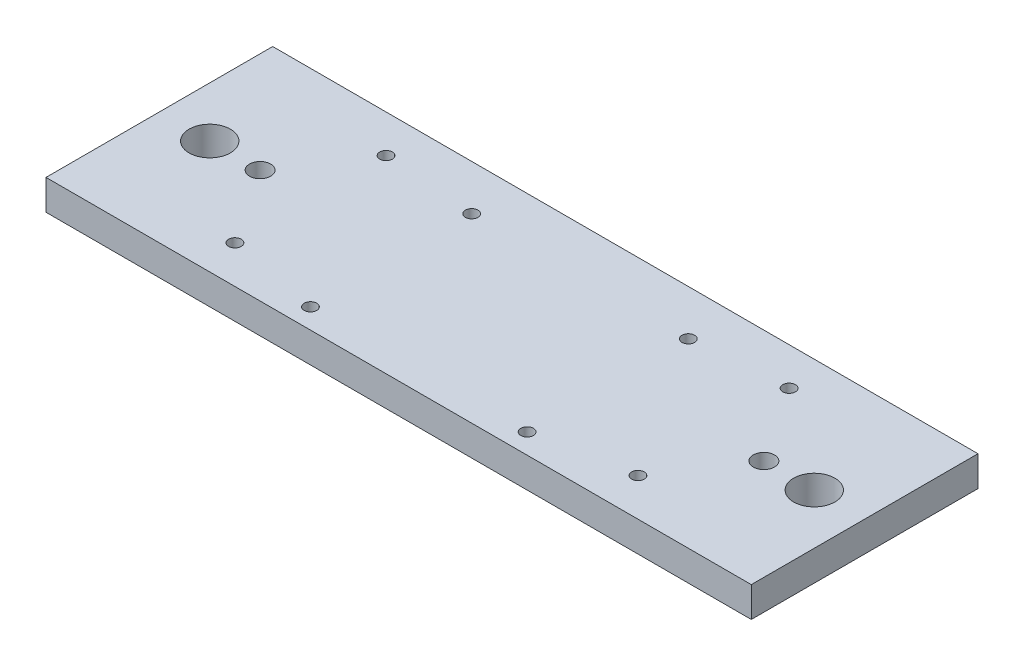
ISO-10303-21;
HEADER;
FILE_DESCRIPTION(('STEP AP214'),'2;1');
FILE_NAME('part.step','',(''),(''),'','','');
FILE_SCHEMA(('AUTOMOTIVE_DESIGN { 1 0 10303 214 1 1 1 1 }'));
ENDSEC;
DATA;
#1=APPLICATION_CONTEXT('core data for automotive mechanical design processes');
#2=APPLICATION_PROTOCOL_DEFINITION('international standard','automotive_design',2000,#1);
#3=PRODUCT_CONTEXT('',#1,'mechanical');
#4=PRODUCT('Part','Part','',(#3));
#5=PRODUCT_RELATED_PRODUCT_CATEGORY('part','',(#4));
#6=PRODUCT_DEFINITION_FORMATION('','',#4);
#7=PRODUCT_DEFINITION_CONTEXT('part definition',#1,'design');
#8=PRODUCT_DEFINITION('design','',#6,#7);
#9=PRODUCT_DEFINITION_SHAPE('','',#8);
#10=(LENGTH_UNIT() NAMED_UNIT(*) SI_UNIT(.MILLI.,.METRE.));
#11=(NAMED_UNIT(*) PLANE_ANGLE_UNIT() SI_UNIT($,.RADIAN.));
#12=(NAMED_UNIT(*) SI_UNIT($,.STERADIAN.) SOLID_ANGLE_UNIT());
#13=UNCERTAINTY_MEASURE_WITH_UNIT(LENGTH_MEASURE(1.E-05),#10,'distance_accuracy_value','');
#14=(GEOMETRIC_REPRESENTATION_CONTEXT(3) GLOBAL_UNCERTAINTY_ASSIGNED_CONTEXT((#13)) GLOBAL_UNIT_ASSIGNED_CONTEXT((#10,
#11,#12)) REPRESENTATION_CONTEXT('',''));
#15=CARTESIAN_POINT('',(0.,0.,0.));
#16=DIRECTION('',(0.,0.,1.));
#17=DIRECTION('',(1.,0.,0.));
#18=AXIS2_PLACEMENT_3D('',#15,#16,#17);
#19=CARTESIAN_POINT('',(0.,6.,0.));
#20=DIRECTION('',(0.,1.,0.));
#21=DIRECTION('',(0.,0.,1.));
#22=AXIS2_PLACEMENT_3D('',#19,#20,#21);
#23=PLANE('',#22);
#24=CARTESIAN_POINT('',(50.,6.,0.));
#25=DIRECTION('',(0.,1.,0.));
#26=DIRECTION('',(0.,0.,1.));
#27=AXIS2_PLACEMENT_3D('',#24,#25,#26);
#28=CIRCLE('',#27,2.09999999999997);
#29=CARTESIAN_POINT('',(50.,6.,2.09999999999997));
#30=VERTEX_POINT('',#29);
#31=EDGE_CURVE('E184',#30,#30,#28,.T.);
#32=ORIENTED_EDGE('',*,*,#31,.F.);
#33=EDGE_LOOP('',(#32));
#34=FACE_BOUND('',#33,.T.);
#35=CARTESIAN_POINT('',(-50.,6.,0.));
#36=DIRECTION('',(0.,1.,0.));
#37=DIRECTION('',(0.,0.,1.));
#38=AXIS2_PLACEMENT_3D('',#35,#36,#37);
#39=CIRCLE('',#38,2.09999999999997);
#40=CARTESIAN_POINT('',(-50.,6.,2.09999999999997));
#41=VERTEX_POINT('',#40);
#42=EDGE_CURVE('E178',#41,#41,#39,.T.);
#43=ORIENTED_EDGE('',*,*,#42,.F.);
#44=EDGE_LOOP('',(#43));
#45=FACE_BOUND('',#44,.T.);
#46=CARTESIAN_POINT('',(-21.5,6.,-13.5));
#47=DIRECTION('',(0.,1.,0.));
#48=DIRECTION('',(0.,0.,1.));
#49=AXIS2_PLACEMENT_3D('',#46,#47,#48);
#50=CIRCLE('',#49,1.24999999999999);
#51=CARTESIAN_POINT('',(-21.5,6.,-12.25));
#52=VERTEX_POINT('',#51);
#53=EDGE_CURVE('E172',#52,#52,#50,.T.);
#54=ORIENTED_EDGE('',*,*,#53,.F.);
#55=EDGE_LOOP('',(#54));
#56=FACE_BOUND('',#55,.T.);
#57=CARTESIAN_POINT('',(21.5,6.,-13.5));
#58=DIRECTION('',(0.,1.,0.));
#59=DIRECTION('',(0.,0.,1.));
#60=AXIS2_PLACEMENT_3D('',#57,#58,#59);
#61=CIRCLE('',#60,1.24999999999999);
#62=CARTESIAN_POINT('',(21.5,6.,-12.25));
#63=VERTEX_POINT('',#62);
#64=EDGE_CURVE('E166',#63,#63,#61,.T.);
#65=ORIENTED_EDGE('',*,*,#64,.F.);
#66=EDGE_LOOP('',(#65));
#67=FACE_BOUND('',#66,.T.);
#68=CARTESIAN_POINT('',(21.5,6.,18.5));
#69=DIRECTION('',(0.,1.,0.));
#70=DIRECTION('',(0.,0.,1.));
#71=AXIS2_PLACEMENT_3D('',#68,#69,#70);
#72=CIRCLE('',#71,1.24999999999999);
#73=CARTESIAN_POINT('',(21.5,6.,19.75));
#74=VERTEX_POINT('',#73);
#75=EDGE_CURVE('E160',#74,#74,#72,.T.);
#76=ORIENTED_EDGE('',*,*,#75,.F.);
#77=EDGE_LOOP('',(#76));
#78=FACE_BOUND('',#77,.T.);
#79=CARTESIAN_POINT('',(-21.5,6.,18.5));
#80=DIRECTION('',(0.,1.,0.));
#81=DIRECTION('',(0.,0.,1.));
#82=AXIS2_PLACEMENT_3D('',#79,#80,#81);
#83=CIRCLE('',#82,1.24999999999999);
#84=CARTESIAN_POINT('',(-21.5,6.,19.75));
#85=VERTEX_POINT('',#84);
#86=EDGE_CURVE('E154',#85,#85,#83,.T.);
#87=ORIENTED_EDGE('',*,*,#86,.F.);
#88=EDGE_LOOP('',(#87));
#89=FACE_BOUND('',#88,.T.);
#90=CARTESIAN_POINT('',(-40.,6.,-15.));
#91=DIRECTION('',(0.,1.,0.));
#92=DIRECTION('',(0.,0.,1.));
#93=AXIS2_PLACEMENT_3D('',#90,#91,#92);
#94=CIRCLE('',#93,1.24999999999999);
#95=CARTESIAN_POINT('',(-40.,6.,-13.75));
#96=VERTEX_POINT('',#95);
#97=EDGE_CURVE('E148',#96,#96,#94,.T.);
#98=ORIENTED_EDGE('',*,*,#97,.F.);
#99=EDGE_LOOP('',(#98));
#100=FACE_BOUND('',#99,.T.);
#101=CARTESIAN_POINT('',(-40.,6.,15.));
#102=DIRECTION('',(0.,1.,0.));
#103=DIRECTION('',(0.,0.,1.));
#104=AXIS2_PLACEMENT_3D('',#101,#102,#103);
#105=CIRCLE('',#104,1.24999999999999);
#106=CARTESIAN_POINT('',(-40.,6.,16.25));
#107=VERTEX_POINT('',#106);
#108=EDGE_CURVE('E142',#107,#107,#105,.T.);
#109=ORIENTED_EDGE('',*,*,#108,.F.);
#110=EDGE_LOOP('',(#109));
#111=FACE_BOUND('',#110,.T.);
#112=CARTESIAN_POINT('',(40.,6.,15.));
#113=DIRECTION('',(0.,1.,0.));
#114=DIRECTION('',(0.,0.,1.));
#115=AXIS2_PLACEMENT_3D('',#112,#113,#114);
#116=CIRCLE('',#115,1.24999999999999);
#117=CARTESIAN_POINT('',(40.,6.,16.25));
#118=VERTEX_POINT('',#117);
#119=EDGE_CURVE('E136',#118,#118,#116,.T.);
#120=ORIENTED_EDGE('',*,*,#119,.F.);
#121=EDGE_LOOP('',(#120));
#122=FACE_BOUND('',#121,.T.);
#123=CARTESIAN_POINT('',(40.,6.,-15.));
#124=DIRECTION('',(0.,1.,0.));
#125=DIRECTION('',(0.,0.,1.));
#126=AXIS2_PLACEMENT_3D('',#123,#124,#125);
#127=CIRCLE('',#126,1.24999999999999);
#128=CARTESIAN_POINT('',(40.,6.,-13.75));
#129=VERTEX_POINT('',#128);
#130=EDGE_CURVE('E130',#129,#129,#127,.T.);
#131=ORIENTED_EDGE('',*,*,#130,.F.);
#132=EDGE_LOOP('',(#131));
#133=FACE_BOUND('',#132,.T.);
#134=CARTESIAN_POINT('',(60.,6.,0.));
#135=DIRECTION('',(0.,1.,0.));
#136=DIRECTION('',(0.,0.,1.));
#137=AXIS2_PLACEMENT_3D('',#134,#135,#136);
#138=CIRCLE('',#137,4.1);
#139=CARTESIAN_POINT('',(60.,6.,4.1));
#140=VERTEX_POINT('',#139);
#141=EDGE_CURVE('E104',#140,#140,#138,.T.);
#142=ORIENTED_EDGE('',*,*,#141,.F.);
#143=EDGE_LOOP('',(#142));
#144=FACE_BOUND('',#143,.T.);
#145=DIRECTION('',(0.,0.,1.));
#146=VECTOR('',#145,1.);
#147=CARTESIAN_POINT('',(-70.,6.,-22.5));
#148=LINE('',#147,#146);
#149=CARTESIAN_POINT('',(-70.,6.,-22.5));
#150=VERTEX_POINT('',#149);
#151=CARTESIAN_POINT('',(-70.,6.,22.5));
#152=VERTEX_POINT('',#151);
#153=EDGE_CURVE('E89',#150,#152,#148,.T.);
#154=ORIENTED_EDGE('',*,*,#153,.T.);
#155=DIRECTION('',(1.,0.,0.));
#156=VECTOR('',#155,1.);
#157=CARTESIAN_POINT('',(-70.,6.,22.5));
#158=LINE('',#157,#156);
#159=CARTESIAN_POINT('',(70.,6.,22.5));
#160=VERTEX_POINT('',#159);
#161=EDGE_CURVE('E84',#152,#160,#158,.T.);
#162=ORIENTED_EDGE('',*,*,#161,.T.);
#163=DIRECTION('',(0.,0.,-1.));
#164=VECTOR('',#163,1.);
#165=CARTESIAN_POINT('',(70.,6.,-22.5));
#166=LINE('',#165,#164);
#167=CARTESIAN_POINT('',(70.,6.,-22.5));
#168=VERTEX_POINT('',#167);
#169=EDGE_CURVE('E87',#160,#168,#166,.T.);
#170=ORIENTED_EDGE('',*,*,#169,.T.);
#171=DIRECTION('',(-1.,0.,0.));
#172=VECTOR('',#171,1.);
#173=CARTESIAN_POINT('',(-70.,6.,-22.5));
#174=LINE('',#173,#172);
#175=EDGE_CURVE('E54',#168,#150,#174,.T.);
#176=ORIENTED_EDGE('',*,*,#175,.T.);
#177=EDGE_LOOP('',(#154,#162,#170,#176));
#178=FACE_BOUND('',#177,.T.);
#179=CARTESIAN_POINT('',(-60.,6.,0.));
#180=DIRECTION('',(0.,1.,0.));
#181=DIRECTION('',(0.,0.,1.));
#182=AXIS2_PLACEMENT_3D('',#179,#180,#181);
#183=CIRCLE('',#182,4.1);
#184=CARTESIAN_POINT('',(-60.,6.,4.1));
#185=VERTEX_POINT('',#184);
#186=EDGE_CURVE('E119',#185,#185,#183,.T.);
#187=ORIENTED_EDGE('',*,*,#186,.F.);
#188=EDGE_LOOP('',(#187));
#189=FACE_BOUND('',#188,.T.);
#190=ADVANCED_FACE('F37',(#34,#45,#56,#67,#78,#89,#100,#111,#122,#133,#144,#178,#189),#23,.T.);
#191=CARTESIAN_POINT('',(0.,0.,0.));
#192=DIRECTION('',(0.,1.,0.));
#193=DIRECTION('',(0.,0.,1.));
#194=AXIS2_PLACEMENT_3D('',#191,#192,#193);
#195=PLANE('',#194);
#196=CARTESIAN_POINT('',(50.,0.,0.));
#197=DIRECTION('',(0.,1.,0.));
#198=DIRECTION('',(0.,0.,1.));
#199=AXIS2_PLACEMENT_3D('',#196,#197,#198);
#200=CIRCLE('',#199,2.09999999999997);
#201=CARTESIAN_POINT('',(50.,0.,2.09999999999997));
#202=VERTEX_POINT('',#201);
#203=EDGE_CURVE('E181',#202,#202,#200,.T.);
#204=ORIENTED_EDGE('',*,*,#203,.T.);
#205=EDGE_LOOP('',(#204));
#206=FACE_BOUND('',#205,.T.);
#207=CARTESIAN_POINT('',(-50.,0.,0.));
#208=DIRECTION('',(0.,1.,0.));
#209=DIRECTION('',(0.,0.,1.));
#210=AXIS2_PLACEMENT_3D('',#207,#208,#209);
#211=CIRCLE('',#210,2.09999999999997);
#212=CARTESIAN_POINT('',(-50.,0.,2.09999999999997));
#213=VERTEX_POINT('',#212);
#214=EDGE_CURVE('E175',#213,#213,#211,.T.);
#215=ORIENTED_EDGE('',*,*,#214,.T.);
#216=EDGE_LOOP('',(#215));
#217=FACE_BOUND('',#216,.T.);
#218=CARTESIAN_POINT('',(-21.5,0.,-13.5));
#219=DIRECTION('',(0.,1.,0.));
#220=DIRECTION('',(0.,0.,1.));
#221=AXIS2_PLACEMENT_3D('',#218,#219,#220);
#222=CIRCLE('',#221,1.25);
#223=CARTESIAN_POINT('',(-21.5,0.,-12.25));
#224=VERTEX_POINT('',#223);
#225=EDGE_CURVE('E169',#224,#224,#222,.T.);
#226=ORIENTED_EDGE('',*,*,#225,.T.);
#227=EDGE_LOOP('',(#226));
#228=FACE_BOUND('',#227,.T.);
#229=CARTESIAN_POINT('',(21.5,0.,-13.5));
#230=DIRECTION('',(0.,1.,0.));
#231=DIRECTION('',(0.,0.,1.));
#232=AXIS2_PLACEMENT_3D('',#229,#230,#231);
#233=CIRCLE('',#232,1.25);
#234=CARTESIAN_POINT('',(21.5,0.,-12.25));
#235=VERTEX_POINT('',#234);
#236=EDGE_CURVE('E163',#235,#235,#233,.T.);
#237=ORIENTED_EDGE('',*,*,#236,.T.);
#238=EDGE_LOOP('',(#237));
#239=FACE_BOUND('',#238,.T.);
#240=CARTESIAN_POINT('',(21.5,0.,18.5));
#241=DIRECTION('',(0.,1.,0.));
#242=DIRECTION('',(0.,0.,1.));
#243=AXIS2_PLACEMENT_3D('',#240,#241,#242);
#244=CIRCLE('',#243,1.25);
#245=CARTESIAN_POINT('',(21.5,0.,19.75));
#246=VERTEX_POINT('',#245);
#247=EDGE_CURVE('E157',#246,#246,#244,.T.);
#248=ORIENTED_EDGE('',*,*,#247,.T.);
#249=EDGE_LOOP('',(#248));
#250=FACE_BOUND('',#249,.T.);
#251=CARTESIAN_POINT('',(-21.5,0.,18.5));
#252=DIRECTION('',(0.,1.,0.));
#253=DIRECTION('',(0.,0.,1.));
#254=AXIS2_PLACEMENT_3D('',#251,#252,#253);
#255=CIRCLE('',#254,1.25);
#256=CARTESIAN_POINT('',(-21.5,0.,19.75));
#257=VERTEX_POINT('',#256);
#258=EDGE_CURVE('E151',#257,#257,#255,.T.);
#259=ORIENTED_EDGE('',*,*,#258,.T.);
#260=EDGE_LOOP('',(#259));
#261=FACE_BOUND('',#260,.T.);
#262=CARTESIAN_POINT('',(-40.,0.,-15.));
#263=DIRECTION('',(0.,1.,0.));
#264=DIRECTION('',(0.,0.,1.));
#265=AXIS2_PLACEMENT_3D('',#262,#263,#264);
#266=CIRCLE('',#265,1.25);
#267=CARTESIAN_POINT('',(-40.,0.,-13.75));
#268=VERTEX_POINT('',#267);
#269=EDGE_CURVE('E145',#268,#268,#266,.T.);
#270=ORIENTED_EDGE('',*,*,#269,.T.);
#271=EDGE_LOOP('',(#270));
#272=FACE_BOUND('',#271,.T.);
#273=CARTESIAN_POINT('',(-40.,0.,15.));
#274=DIRECTION('',(0.,1.,0.));
#275=DIRECTION('',(0.,0.,1.));
#276=AXIS2_PLACEMENT_3D('',#273,#274,#275);
#277=CIRCLE('',#276,1.25);
#278=CARTESIAN_POINT('',(-40.,0.,16.25));
#279=VERTEX_POINT('',#278);
#280=EDGE_CURVE('E139',#279,#279,#277,.T.);
#281=ORIENTED_EDGE('',*,*,#280,.T.);
#282=EDGE_LOOP('',(#281));
#283=FACE_BOUND('',#282,.T.);
#284=CARTESIAN_POINT('',(40.,0.,15.));
#285=DIRECTION('',(0.,1.,0.));
#286=DIRECTION('',(0.,0.,1.));
#287=AXIS2_PLACEMENT_3D('',#284,#285,#286);
#288=CIRCLE('',#287,1.25);
#289=CARTESIAN_POINT('',(40.,0.,16.25));
#290=VERTEX_POINT('',#289);
#291=EDGE_CURVE('E133',#290,#290,#288,.T.);
#292=ORIENTED_EDGE('',*,*,#291,.T.);
#293=EDGE_LOOP('',(#292));
#294=FACE_BOUND('',#293,.T.);
#295=CARTESIAN_POINT('',(40.,0.,-15.));
#296=DIRECTION('',(0.,1.,0.));
#297=DIRECTION('',(0.,0.,1.));
#298=AXIS2_PLACEMENT_3D('',#295,#296,#297);
#299=CIRCLE('',#298,1.25);
#300=CARTESIAN_POINT('',(40.,0.,-13.75));
#301=VERTEX_POINT('',#300);
#302=EDGE_CURVE('E125',#301,#301,#299,.T.);
#303=ORIENTED_EDGE('',*,*,#302,.T.);
#304=EDGE_LOOP('',(#303));
#305=FACE_BOUND('',#304,.T.);
#306=DIRECTION('',(0.,0.,1.));
#307=VECTOR('',#306,1.);
#308=CARTESIAN_POINT('',(-70.,0.,-22.5));
#309=LINE('',#308,#307);
#310=CARTESIAN_POINT('',(-70.,0.,-22.5));
#311=VERTEX_POINT('',#310);
#312=CARTESIAN_POINT('',(-70.,0.,22.5));
#313=VERTEX_POINT('',#312);
#314=EDGE_CURVE('E101',#311,#313,#309,.T.);
#315=ORIENTED_EDGE('',*,*,#314,.F.);
#316=DIRECTION('',(-1.,0.,0.));
#317=VECTOR('',#316,1.);
#318=CARTESIAN_POINT('',(-70.,0.,-22.5));
#319=LINE('',#318,#317);
#320=CARTESIAN_POINT('',(70.,0.,-22.5));
#321=VERTEX_POINT('',#320);
#322=EDGE_CURVE('E77',#321,#311,#319,.T.);
#323=ORIENTED_EDGE('',*,*,#322,.F.);
#324=DIRECTION('',(0.,0.,-1.));
#325=VECTOR('',#324,1.);
#326=CARTESIAN_POINT('',(70.,0.,-22.5));
#327=LINE('',#326,#325);
#328=CARTESIAN_POINT('',(70.,0.,22.5));
#329=VERTEX_POINT('',#328);
#330=EDGE_CURVE('E71',#329,#321,#327,.T.);
#331=ORIENTED_EDGE('',*,*,#330,.F.);
#332=DIRECTION('',(1.,0.,0.));
#333=VECTOR('',#332,1.);
#334=CARTESIAN_POINT('',(-70.,0.,22.5));
#335=LINE('',#334,#333);
#336=EDGE_CURVE('E93',#313,#329,#335,.T.);
#337=ORIENTED_EDGE('',*,*,#336,.F.);
#338=EDGE_LOOP('',(#315,#323,#331,#337));
#339=FACE_BOUND('',#338,.T.);
#340=CARTESIAN_POINT('',(60.,0.,0.));
#341=DIRECTION('',(0.,1.,0.));
#342=DIRECTION('',(0.,0.,1.));
#343=AXIS2_PLACEMENT_3D('',#340,#341,#342);
#344=CIRCLE('',#343,4.1);
#345=CARTESIAN_POINT('',(60.,0.,4.1));
#346=VERTEX_POINT('',#345);
#347=EDGE_CURVE('E116',#346,#346,#344,.T.);
#348=ORIENTED_EDGE('',*,*,#347,.T.);
#349=EDGE_LOOP('',(#348));
#350=FACE_BOUND('',#349,.T.);
#351=CARTESIAN_POINT('',(-60.,0.,0.));
#352=DIRECTION('',(0.,1.,0.));
#353=DIRECTION('',(0.,0.,1.));
#354=AXIS2_PLACEMENT_3D('',#351,#352,#353);
#355=CIRCLE('',#354,4.1);
#356=CARTESIAN_POINT('',(-60.,0.,4.1));
#357=VERTEX_POINT('',#356);
#358=EDGE_CURVE('E122',#357,#357,#355,.T.);
#359=ORIENTED_EDGE('',*,*,#358,.T.);
#360=EDGE_LOOP('',(#359));
#361=FACE_BOUND('',#360,.T.);
#362=ADVANCED_FACE('F112',(#206,#217,#228,#239,#250,#261,#272,#283,#294,#305,#339,#350,#361),
#195,.F.);
#363=CARTESIAN_POINT('',(-70.,6.,-22.5));
#364=DIRECTION('',(1.,0.,0.));
#365=DIRECTION('',(0.,0.,-1.));
#366=AXIS2_PLACEMENT_3D('',#363,#364,#365);
#367=PLANE('',#366);
#368=ORIENTED_EDGE('',*,*,#314,.T.);
#369=DIRECTION('',(0.,-1.,0.));
#370=VECTOR('',#369,1.);
#371=CARTESIAN_POINT('',(-70.,6.,22.5));
#372=LINE('',#371,#370);
#373=EDGE_CURVE('E11',#152,#313,#372,.T.);
#374=ORIENTED_EDGE('',*,*,#373,.F.);
#375=ORIENTED_EDGE('',*,*,#153,.F.);
#376=DIRECTION('',(0.,-1.,0.));
#377=VECTOR('',#376,1.);
#378=CARTESIAN_POINT('',(-70.,6.,-22.5));
#379=LINE('',#378,#377);
#380=EDGE_CURVE('E97',#150,#311,#379,.T.);
#381=ORIENTED_EDGE('',*,*,#380,.T.);
#382=EDGE_LOOP('',(#368,#374,#375,#381));
#383=FACE_BOUND('',#382,.T.);
#384=ADVANCED_FACE('F39',(#383),#367,.F.);
#385=CARTESIAN_POINT('',(-70.,6.,22.5));
#386=DIRECTION('',(0.,0.,-1.));
#387=DIRECTION('',(-1.,0.,0.));
#388=AXIS2_PLACEMENT_3D('',#385,#386,#387);
#389=PLANE('',#388);
#390=ORIENTED_EDGE('',*,*,#336,.T.);
#391=DIRECTION('',(0.,-1.,0.));
#392=VECTOR('',#391,1.);
#393=CARTESIAN_POINT('',(70.,6.,22.5));
#394=LINE('',#393,#392);
#395=EDGE_CURVE('E46',#160,#329,#394,.T.);
#396=ORIENTED_EDGE('',*,*,#395,.F.);
#397=ORIENTED_EDGE('',*,*,#161,.F.);
#398=ORIENTED_EDGE('',*,*,#373,.T.);
#399=EDGE_LOOP('',(#390,#396,#397,#398));
#400=FACE_BOUND('',#399,.T.);
#401=ADVANCED_FACE('F92',(#400),#389,.F.);
#402=CARTESIAN_POINT('',(70.,6.,-22.5));
#403=DIRECTION('',(-1.,0.,0.));
#404=DIRECTION('',(0.,0.,1.));
#405=AXIS2_PLACEMENT_3D('',#402,#403,#404);
#406=PLANE('',#405);
#407=ORIENTED_EDGE('',*,*,#330,.T.);
#408=DIRECTION('',(0.,-1.,0.));
#409=VECTOR('',#408,1.);
#410=CARTESIAN_POINT('',(70.,6.,-22.5));
#411=LINE('',#410,#409);
#412=EDGE_CURVE('E94',#168,#321,#411,.T.);
#413=ORIENTED_EDGE('',*,*,#412,.F.);
#414=ORIENTED_EDGE('',*,*,#169,.F.);
#415=ORIENTED_EDGE('',*,*,#395,.T.);
#416=EDGE_LOOP('',(#407,#413,#414,#415));
#417=FACE_BOUND('',#416,.T.);
#418=ADVANCED_FACE('F95',(#417),#406,.F.);
#419=CARTESIAN_POINT('',(-70.,6.,-22.5));
#420=DIRECTION('',(0.,0.,1.));
#421=DIRECTION('',(1.,0.,0.));
#422=AXIS2_PLACEMENT_3D('',#419,#420,#421);
#423=PLANE('',#422);
#424=ORIENTED_EDGE('',*,*,#322,.T.);
#425=ORIENTED_EDGE('',*,*,#380,.F.);
#426=ORIENTED_EDGE('',*,*,#175,.F.);
#427=ORIENTED_EDGE('',*,*,#412,.T.);
#428=EDGE_LOOP('',(#424,#425,#426,#427));
#429=FACE_BOUND('',#428,.T.);
#430=ADVANCED_FACE('F109',(#429),#423,.F.);
#431=CARTESIAN_POINT('',(60.,6.,0.));
#432=DIRECTION('',(0.,-1.,0.));
#433=DIRECTION('',(0.,0.,-1.));
#434=AXIS2_PLACEMENT_3D('',#431,#432,#433);
#435=CYLINDRICAL_SURFACE('',#434,4.1);
#436=ORIENTED_EDGE('',*,*,#141,.T.);
#437=EDGE_LOOP('',(#436));
#438=FACE_BOUND('',#437,.T.);
#439=ORIENTED_EDGE('',*,*,#347,.F.);
#440=EDGE_LOOP('',(#439));
#441=FACE_BOUND('',#440,.T.);
#442=ADVANCED_FACE('F213',(#438,#441),#435,.F.);
#443=CARTESIAN_POINT('',(-60.,6.,0.));
#444=DIRECTION('',(0.,-1.,0.));
#445=DIRECTION('',(0.,0.,-1.));
#446=AXIS2_PLACEMENT_3D('',#443,#444,#445);
#447=CYLINDRICAL_SURFACE('',#446,4.1);
#448=ORIENTED_EDGE('',*,*,#186,.T.);
#449=EDGE_LOOP('',(#448));
#450=FACE_BOUND('',#449,.T.);
#451=ORIENTED_EDGE('',*,*,#358,.F.);
#452=EDGE_LOOP('',(#451));
#453=FACE_BOUND('',#452,.T.);
#454=ADVANCED_FACE('F216',(#450,#453),#447,.F.);
#455=CARTESIAN_POINT('',(40.,6.,-15.));
#456=DIRECTION('',(0.,1.,0.));
#457=DIRECTION('',(0.,0.,1.));
#458=AXIS2_PLACEMENT_3D('',#455,#456,#457);
#459=CYLINDRICAL_SURFACE('',#458,1.24999999999999);
#460=ORIENTED_EDGE('',*,*,#302,.F.);
#461=EDGE_LOOP('',(#460));
#462=FACE_BOUND('',#461,.T.);
#463=ORIENTED_EDGE('',*,*,#130,.T.);
#464=EDGE_LOOP('',(#463));
#465=FACE_BOUND('',#464,.T.);
#466=ADVANCED_FACE('F226',(#462,#465),#459,.F.);
#467=CARTESIAN_POINT('',(40.,6.,15.));
#468=DIRECTION('',(0.,1.,0.));
#469=DIRECTION('',(0.,0.,1.));
#470=AXIS2_PLACEMENT_3D('',#467,#468,#469);
#471=CYLINDRICAL_SURFACE('',#470,1.24999999999999);
#472=ORIENTED_EDGE('',*,*,#291,.F.);
#473=EDGE_LOOP('',(#472));
#474=FACE_BOUND('',#473,.T.);
#475=ORIENTED_EDGE('',*,*,#119,.T.);
#476=EDGE_LOOP('',(#475));
#477=FACE_BOUND('',#476,.T.);
#478=ADVANCED_FACE('F232',(#474,#477),#471,.F.);
#479=CARTESIAN_POINT('',(-40.,6.,15.));
#480=DIRECTION('',(0.,1.,0.));
#481=DIRECTION('',(0.,0.,1.));
#482=AXIS2_PLACEMENT_3D('',#479,#480,#481);
#483=CYLINDRICAL_SURFACE('',#482,1.24999999999999);
#484=ORIENTED_EDGE('',*,*,#280,.F.);
#485=EDGE_LOOP('',(#484));
#486=FACE_BOUND('',#485,.T.);
#487=ORIENTED_EDGE('',*,*,#108,.T.);
#488=EDGE_LOOP('',(#487));
#489=FACE_BOUND('',#488,.T.);
#490=ADVANCED_FACE('F315',(#486,#489),#483,.F.);
#491=CARTESIAN_POINT('',(-40.,6.,-15.));
#492=DIRECTION('',(0.,1.,0.));
#493=DIRECTION('',(0.,0.,1.));
#494=AXIS2_PLACEMENT_3D('',#491,#492,#493);
#495=CYLINDRICAL_SURFACE('',#494,1.24999999999999);
#496=ORIENTED_EDGE('',*,*,#269,.F.);
#497=EDGE_LOOP('',(#496));
#498=FACE_BOUND('',#497,.T.);
#499=ORIENTED_EDGE('',*,*,#97,.T.);
#500=EDGE_LOOP('',(#499));
#501=FACE_BOUND('',#500,.T.);
#502=ADVANCED_FACE('F304',(#498,#501),#495,.F.);
#503=CARTESIAN_POINT('',(-21.5,6.,18.5));
#504=DIRECTION('',(0.,1.,0.));
#505=DIRECTION('',(0.,0.,1.));
#506=AXIS2_PLACEMENT_3D('',#503,#504,#505);
#507=CYLINDRICAL_SURFACE('',#506,1.24999999999999);
#508=ORIENTED_EDGE('',*,*,#258,.F.);
#509=EDGE_LOOP('',(#508));
#510=FACE_BOUND('',#509,.T.);
#511=ORIENTED_EDGE('',*,*,#86,.T.);
#512=EDGE_LOOP('',(#511));
#513=FACE_BOUND('',#512,.T.);
#514=ADVANCED_FACE('F293',(#510,#513),#507,.F.);
#515=CARTESIAN_POINT('',(21.5,6.,18.5));
#516=DIRECTION('',(0.,1.,0.));
#517=DIRECTION('',(0.,0.,1.));
#518=AXIS2_PLACEMENT_3D('',#515,#516,#517);
#519=CYLINDRICAL_SURFACE('',#518,1.24999999999999);
#520=ORIENTED_EDGE('',*,*,#247,.F.);
#521=EDGE_LOOP('',(#520));
#522=FACE_BOUND('',#521,.T.);
#523=ORIENTED_EDGE('',*,*,#75,.T.);
#524=EDGE_LOOP('',(#523));
#525=FACE_BOUND('',#524,.T.);
#526=ADVANCED_FACE('F282',(#522,#525),#519,.F.);
#527=CARTESIAN_POINT('',(21.5,6.,-13.5));
#528=DIRECTION('',(0.,1.,0.));
#529=DIRECTION('',(0.,0.,1.));
#530=AXIS2_PLACEMENT_3D('',#527,#528,#529);
#531=CYLINDRICAL_SURFACE('',#530,1.24999999999999);
#532=ORIENTED_EDGE('',*,*,#236,.F.);
#533=EDGE_LOOP('',(#532));
#534=FACE_BOUND('',#533,.T.);
#535=ORIENTED_EDGE('',*,*,#64,.T.);
#536=EDGE_LOOP('',(#535));
#537=FACE_BOUND('',#536,.T.);
#538=ADVANCED_FACE('F269',(#534,#537),#531,.F.);
#539=CARTESIAN_POINT('',(-21.5,6.,-13.5));
#540=DIRECTION('',(0.,1.,0.));
#541=DIRECTION('',(0.,0.,1.));
#542=AXIS2_PLACEMENT_3D('',#539,#540,#541);
#543=CYLINDRICAL_SURFACE('',#542,1.24999999999999);
#544=ORIENTED_EDGE('',*,*,#225,.F.);
#545=EDGE_LOOP('',(#544));
#546=FACE_BOUND('',#545,.T.);
#547=ORIENTED_EDGE('',*,*,#53,.T.);
#548=EDGE_LOOP('',(#547));
#549=FACE_BOUND('',#548,.T.);
#550=ADVANCED_FACE('F262',(#546,#549),#543,.F.);
#551=CARTESIAN_POINT('',(-50.,6.,0.));
#552=DIRECTION('',(0.,1.,0.));
#553=DIRECTION('',(0.,0.,1.));
#554=AXIS2_PLACEMENT_3D('',#551,#552,#553);
#555=CYLINDRICAL_SURFACE('',#554,2.09999999999997);
#556=ORIENTED_EDGE('',*,*,#214,.F.);
#557=EDGE_LOOP('',(#556));
#558=FACE_BOUND('',#557,.T.);
#559=ORIENTED_EDGE('',*,*,#42,.T.);
#560=EDGE_LOOP('',(#559));
#561=FACE_BOUND('',#560,.T.);
#562=ADVANCED_FACE('F268',(#558,#561),#555,.F.);
#563=CARTESIAN_POINT('',(50.,6.,0.));
#564=DIRECTION('',(0.,1.,0.));
#565=DIRECTION('',(0.,0.,1.));
#566=AXIS2_PLACEMENT_3D('',#563,#564,#565);
#567=CYLINDRICAL_SURFACE('',#566,2.09999999999997);
#568=ORIENTED_EDGE('',*,*,#203,.F.);
#569=EDGE_LOOP('',(#568));
#570=FACE_BOUND('',#569,.T.);
#571=ORIENTED_EDGE('',*,*,#31,.T.);
#572=EDGE_LOOP('',(#571));
#573=FACE_BOUND('',#572,.T.);
#574=ADVANCED_FACE('F188',(#570,#573),#567,.F.);
#575=CLOSED_SHELL('',(#190,#362,#384,#401,#418,#430,#442,#454,#466,#478,#490,#502,#514,#526,
#538,#550,#562,#574));
#576=MANIFOLD_SOLID_BREP('B2',#575);
#577=ADVANCED_BREP_SHAPE_REPRESENTATION('',(#18,#576),#14);
#578=SHAPE_DEFINITION_REPRESENTATION(#9,#577);
ENDSEC;
END-ISO-10303-21;
